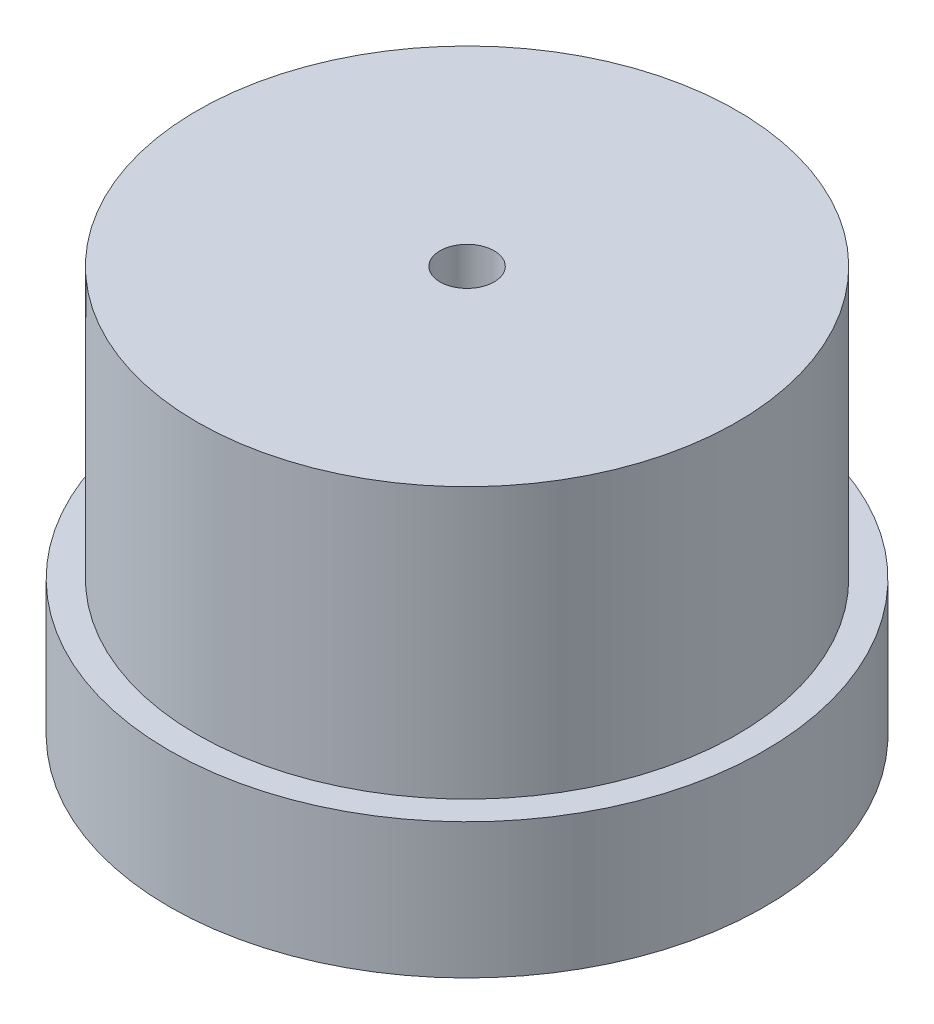
ISO-10303-21;
HEADER;
FILE_DESCRIPTION(('STEP AP214'),'2;1');
FILE_NAME('part.step','',(''),(''),'','','');
FILE_SCHEMA(('AUTOMOTIVE_DESIGN { 1 0 10303 214 1 1 1 1 }'));
ENDSEC;
DATA;
#1=APPLICATION_CONTEXT('core data for automotive mechanical design processes');
#2=APPLICATION_PROTOCOL_DEFINITION('international standard','automotive_design',2000,#1);
#3=PRODUCT_CONTEXT('',#1,'mechanical');
#4=PRODUCT('Part','Part','',(#3));
#5=PRODUCT_RELATED_PRODUCT_CATEGORY('part','',(#4));
#6=PRODUCT_DEFINITION_FORMATION('','',#4);
#7=PRODUCT_DEFINITION_CONTEXT('part definition',#1,'design');
#8=PRODUCT_DEFINITION('design','',#6,#7);
#9=PRODUCT_DEFINITION_SHAPE('','',#8);
#10=(LENGTH_UNIT() NAMED_UNIT(*) SI_UNIT(.MILLI.,.METRE.));
#11=(NAMED_UNIT(*) PLANE_ANGLE_UNIT() SI_UNIT($,.RADIAN.));
#12=(NAMED_UNIT(*) SI_UNIT($,.STERADIAN.) SOLID_ANGLE_UNIT());
#13=UNCERTAINTY_MEASURE_WITH_UNIT(LENGTH_MEASURE(1.E-05),#10,'distance_accuracy_value','');
#14=(GEOMETRIC_REPRESENTATION_CONTEXT(3) GLOBAL_UNCERTAINTY_ASSIGNED_CONTEXT((#13)) GLOBAL_UNIT_ASSIGNED_CONTEXT((#10,
#11,#12)) REPRESENTATION_CONTEXT('',''));
#15=CARTESIAN_POINT('',(0.,0.,0.));
#16=DIRECTION('',(0.,0.,1.));
#17=DIRECTION('',(1.,0.,0.));
#18=AXIS2_PLACEMENT_3D('',#15,#16,#17);
#19=CARTESIAN_POINT('',(0.,10.,0.));
#20=DIRECTION('',(0.,-1.,0.));
#21=DIRECTION('',(0.,0.,-1.));
#22=AXIS2_PLACEMENT_3D('',#19,#20,#21);
#23=CYLINDRICAL_SURFACE('',#22,22.);
#24=CARTESIAN_POINT('',(0.,10.,0.));
#25=DIRECTION('',(0.,1.,0.));
#26=DIRECTION('',(0.,0.,1.));
#27=AXIS2_PLACEMENT_3D('',#24,#25,#26);
#28=CIRCLE('',#27,22.);
#29=CARTESIAN_POINT('',(0.,10.,22.));
#30=VERTEX_POINT('',#29);
#31=EDGE_CURVE('E10',#30,#30,#28,.T.);
#32=ORIENTED_EDGE('',*,*,#31,.F.);
#33=EDGE_LOOP('',(#32));
#34=FACE_BOUND('',#33,.T.);
#35=CARTESIAN_POINT('',(0.,0.,0.));
#36=DIRECTION('',(0.,1.,0.));
#37=DIRECTION('',(0.,0.,1.));
#38=AXIS2_PLACEMENT_3D('',#35,#36,#37);
#39=CIRCLE('',#38,22.);
#40=CARTESIAN_POINT('',(0.,0.,22.));
#41=VERTEX_POINT('',#40);
#42=EDGE_CURVE('E34',#41,#41,#39,.T.);
#43=ORIENTED_EDGE('',*,*,#42,.T.);
#44=EDGE_LOOP('',(#43));
#45=FACE_BOUND('',#44,.T.);
#46=ADVANCED_FACE('F31',(#34,#45),#23,.T.);
#47=CARTESIAN_POINT('',(0.,10.,0.));
#48=DIRECTION('',(0.,1.,0.));
#49=DIRECTION('',(0.,0.,1.));
#50=AXIS2_PLACEMENT_3D('',#47,#48,#49);
#51=PLANE('',#50);
#52=CARTESIAN_POINT('',(0.,10.,0.));
#53=DIRECTION('',(0.,1.,0.));
#54=DIRECTION('',(0.,0.,1.));
#55=AXIS2_PLACEMENT_3D('',#52,#53,#54);
#56=CIRCLE('',#55,19.95);
#57=CARTESIAN_POINT('',(0.,10.,19.95));
#58=VERTEX_POINT('',#57);
#59=EDGE_CURVE('E43',#58,#58,#56,.T.);
#60=ORIENTED_EDGE('',*,*,#59,.F.);
#61=EDGE_LOOP('',(#60));
#62=FACE_BOUND('',#61,.T.);
#63=ORIENTED_EDGE('',*,*,#31,.T.);
#64=EDGE_LOOP('',(#63));
#65=FACE_BOUND('',#64,.T.);
#66=ADVANCED_FACE('F76',(#62,#65),#51,.T.);
#67=CARTESIAN_POINT('',(0.,0.,0.));
#68=DIRECTION('',(0.,1.,0.));
#69=DIRECTION('',(0.,0.,1.));
#70=AXIS2_PLACEMENT_3D('',#67,#68,#69);
#71=PLANE('',#70);
#72=CARTESIAN_POINT('',(0.,0.,0.));
#73=DIRECTION('',(0.,1.,0.));
#74=DIRECTION('',(0.,0.,1.));
#75=AXIS2_PLACEMENT_3D('',#72,#73,#74);
#76=CIRCLE('',#75,2.);
#77=CARTESIAN_POINT('',(0.,0.,2.));
#78=VERTEX_POINT('',#77);
#79=EDGE_CURVE('E46',#78,#78,#76,.T.);
#80=ORIENTED_EDGE('',*,*,#79,.T.);
#81=EDGE_LOOP('',(#80));
#82=FACE_BOUND('',#81,.T.);
#83=ORIENTED_EDGE('',*,*,#42,.F.);
#84=EDGE_LOOP('',(#83));
#85=FACE_BOUND('',#84,.T.);
#86=ADVANCED_FACE('F55',(#82,#85),#71,.F.);
#87=CARTESIAN_POINT('',(0.,30.,0.));
#88=DIRECTION('',(0.,-1.,0.));
#89=DIRECTION('',(0.,0.,-1.));
#90=AXIS2_PLACEMENT_3D('',#87,#88,#89);
#91=CYLINDRICAL_SURFACE('',#90,19.95);
#92=CARTESIAN_POINT('',(0.,30.,0.));
#93=DIRECTION('',(0.,1.,0.));
#94=DIRECTION('',(0.,0.,1.));
#95=AXIS2_PLACEMENT_3D('',#92,#93,#94);
#96=CIRCLE('',#95,19.95);
#97=CARTESIAN_POINT('',(0.,30.,19.95));
#98=VERTEX_POINT('',#97);
#99=EDGE_CURVE('E41',#98,#98,#96,.T.);
#100=ORIENTED_EDGE('',*,*,#99,.F.);
#101=EDGE_LOOP('',(#100));
#102=FACE_BOUND('',#101,.T.);
#103=ORIENTED_EDGE('',*,*,#59,.T.);
#104=EDGE_LOOP('',(#103));
#105=FACE_BOUND('',#104,.T.);
#106=ADVANCED_FACE('F67',(#102,#105),#91,.T.);
#107=CARTESIAN_POINT('',(0.,30.,0.));
#108=DIRECTION('',(0.,1.,0.));
#109=DIRECTION('',(0.,0.,1.));
#110=AXIS2_PLACEMENT_3D('',#107,#108,#109);
#111=PLANE('',#110);
#112=CARTESIAN_POINT('',(0.,30.,0.));
#113=DIRECTION('',(0.,1.,0.));
#114=DIRECTION('',(0.,0.,1.));
#115=AXIS2_PLACEMENT_3D('',#112,#113,#114);
#116=CIRCLE('',#115,2.);
#117=CARTESIAN_POINT('',(0.,30.,2.));
#118=VERTEX_POINT('',#117);
#119=EDGE_CURVE('E49',#118,#118,#116,.T.);
#120=ORIENTED_EDGE('',*,*,#119,.F.);
#121=EDGE_LOOP('',(#120));
#122=FACE_BOUND('',#121,.T.);
#123=ORIENTED_EDGE('',*,*,#99,.T.);
#124=EDGE_LOOP('',(#123));
#125=FACE_BOUND('',#124,.T.);
#126=ADVANCED_FACE('F61',(#122,#125),#111,.T.);
#127=CARTESIAN_POINT('',(0.,0.,0.));
#128=DIRECTION('',(0.,1.,0.));
#129=DIRECTION('',(0.,0.,1.));
#130=AXIS2_PLACEMENT_3D('',#127,#128,#129);
#131=CYLINDRICAL_SURFACE('',#130,2.);
#132=ORIENTED_EDGE('',*,*,#79,.F.);
#133=EDGE_LOOP('',(#132));
#134=FACE_BOUND('',#133,.T.);
#135=ORIENTED_EDGE('',*,*,#119,.T.);
#136=EDGE_LOOP('',(#135));
#137=FACE_BOUND('',#136,.T.);
#138=ADVANCED_FACE('F58',(#134,#137),#131,.F.);
#139=CLOSED_SHELL('',(#46,#66,#86,#106,#126,#138));
#140=MANIFOLD_SOLID_BREP('B2',#139);
#141=ADVANCED_BREP_SHAPE_REPRESENTATION('',(#18,#140),#14);
#142=SHAPE_DEFINITION_REPRESENTATION(#9,#141);
ENDSEC;
END-ISO-10303-21;
